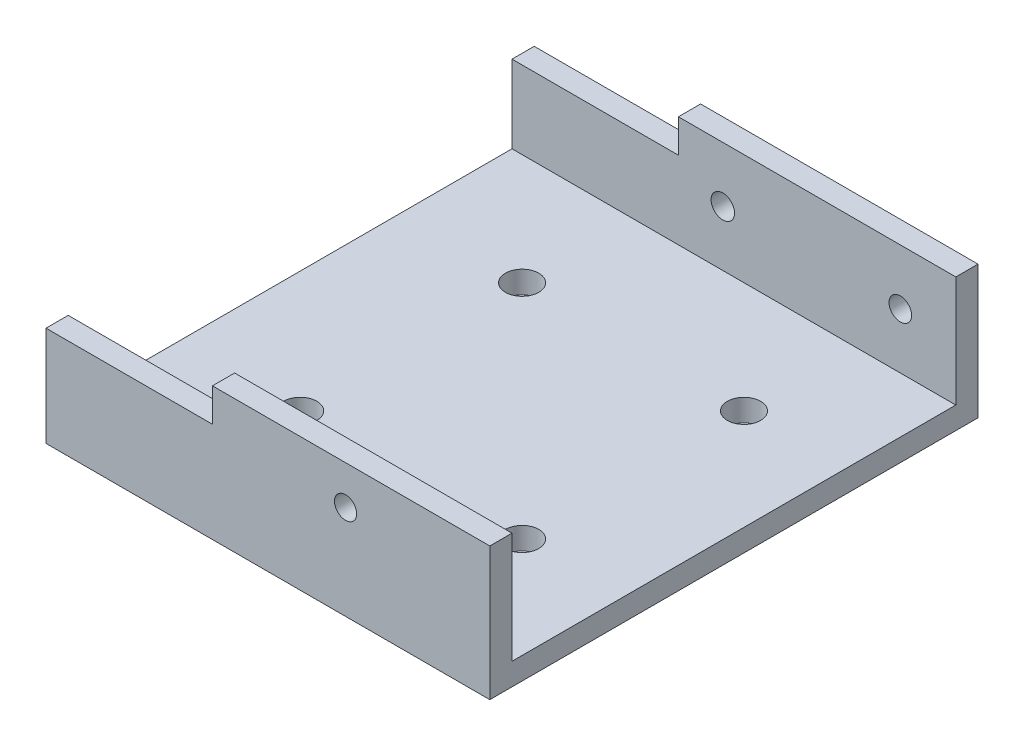
ISO-10303-21;
HEADER;
FILE_DESCRIPTION(('STEP AP214'),'2;1');
FILE_NAME('part.step','',(''),(''),'','','');
FILE_SCHEMA(('AUTOMOTIVE_DESIGN { 1 0 10303 214 1 1 1 1 }'));
ENDSEC;
DATA;
#1=APPLICATION_CONTEXT('core data for automotive mechanical design processes');
#2=APPLICATION_PROTOCOL_DEFINITION('international standard','automotive_design',2000,#1);
#3=PRODUCT_CONTEXT('',#1,'mechanical');
#4=PRODUCT('Part','Part','',(#3));
#5=PRODUCT_RELATED_PRODUCT_CATEGORY('part','',(#4));
#6=PRODUCT_DEFINITION_FORMATION('','',#4);
#7=PRODUCT_DEFINITION_CONTEXT('part definition',#1,'design');
#8=PRODUCT_DEFINITION('design','',#6,#7);
#9=PRODUCT_DEFINITION_SHAPE('','',#8);
#10=(LENGTH_UNIT() NAMED_UNIT(*) SI_UNIT(.MILLI.,.METRE.));
#11=(NAMED_UNIT(*) PLANE_ANGLE_UNIT() SI_UNIT($,.RADIAN.));
#12=(NAMED_UNIT(*) SI_UNIT($,.STERADIAN.) SOLID_ANGLE_UNIT());
#13=UNCERTAINTY_MEASURE_WITH_UNIT(LENGTH_MEASURE(1.E-05),#10,'distance_accuracy_value','');
#14=(GEOMETRIC_REPRESENTATION_CONTEXT(3) GLOBAL_UNCERTAINTY_ASSIGNED_CONTEXT((#13)) GLOBAL_UNIT_ASSIGNED_CONTEXT((#10,
#11,#12)) REPRESENTATION_CONTEXT('',''));
#15=CARTESIAN_POINT('',(0.,0.,0.));
#16=DIRECTION('',(0.,0.,1.));
#17=DIRECTION('',(1.,0.,0.));
#18=AXIS2_PLACEMENT_3D('',#15,#16,#17);
#19=CARTESIAN_POINT('',(0.,2.,0.));
#20=DIRECTION('',(0.,-1.,0.));
#21=DIRECTION('',(0.,0.,-1.));
#22=AXIS2_PLACEMENT_3D('',#19,#20,#21);
#23=PLANE('',#22);
#24=CARTESIAN_POINT('',(30.9090909090909,2.,-32.));
#25=DIRECTION('',(0.,-1.,0.));
#26=DIRECTION('',(0.,0.,-1.));
#27=AXIS2_PLACEMENT_3D('',#24,#25,#26);
#28=CIRCLE('',#27,1.5);
#29=CARTESIAN_POINT('',(30.9090909090909,2.,-33.5));
#30=VERTEX_POINT('',#29);
#31=EDGE_CURVE('E473',#30,#30,#28,.F.);
#32=ORIENTED_EDGE('',*,*,#31,.F.);
#33=EDGE_LOOP('',(#32));
#34=FACE_BOUND('',#33,.T.);
#35=CARTESIAN_POINT('',(30.9090909090909,2.,-12.));
#36=DIRECTION('',(0.,-1.,0.));
#37=DIRECTION('',(0.,0.,-1.));
#38=AXIS2_PLACEMENT_3D('',#35,#36,#37);
#39=CIRCLE('',#38,1.5);
#40=CARTESIAN_POINT('',(30.9090909090909,2.,-13.5));
#41=VERTEX_POINT('',#40);
#42=EDGE_CURVE('E477',#41,#41,#39,.F.);
#43=ORIENTED_EDGE('',*,*,#42,.F.);
#44=EDGE_LOOP('',(#43));
#45=FACE_BOUND('',#44,.T.);
#46=CARTESIAN_POINT('',(10.9090909090909,2.,-12.));
#47=DIRECTION('',(0.,-1.,0.));
#48=DIRECTION('',(0.,0.,-1.));
#49=AXIS2_PLACEMENT_3D('',#46,#47,#48);
#50=CIRCLE('',#49,1.5);
#51=CARTESIAN_POINT('',(10.9090909090909,2.,-13.5));
#52=VERTEX_POINT('',#51);
#53=EDGE_CURVE('E484',#52,#52,#50,.F.);
#54=ORIENTED_EDGE('',*,*,#53,.F.);
#55=EDGE_LOOP('',(#54));
#56=FACE_BOUND('',#55,.T.);
#57=CARTESIAN_POINT('',(10.9090909090909,2.,-32.));
#58=DIRECTION('',(0.,-1.,0.));
#59=DIRECTION('',(0.,0.,-1.));
#60=AXIS2_PLACEMENT_3D('',#57,#58,#59);
#61=CIRCLE('',#60,1.5);
#62=CARTESIAN_POINT('',(10.9090909090909,2.,-33.5));
#63=VERTEX_POINT('',#62);
#64=EDGE_CURVE('E290',#63,#63,#61,.F.);
#65=ORIENTED_EDGE('',*,*,#64,.F.);
#66=EDGE_LOOP('',(#65));
#67=FACE_BOUND('',#66,.T.);
#68=DIRECTION('',(-1.,0.,0.));
#69=VECTOR('',#68,1.);
#70=CARTESIAN_POINT('',(0.,2.,-2.));
#71=LINE('',#70,#69);
#72=CARTESIAN_POINT('',(40.,2.,-2.));
#73=VERTEX_POINT('',#72);
#74=CARTESIAN_POINT('',(0.,2.,-2.));
#75=VERTEX_POINT('',#74);
#76=EDGE_CURVE('E161',#73,#75,#71,.T.);
#77=ORIENTED_EDGE('',*,*,#76,.F.);
#78=DIRECTION('',(0.,0.,-1.));
#79=VECTOR('',#78,1.);
#80=CARTESIAN_POINT('',(40.,2.,0.));
#81=LINE('',#80,#79);
#82=CARTESIAN_POINT('',(40.,2.,-42.));
#83=VERTEX_POINT('',#82);
#84=EDGE_CURVE('E195',#73,#83,#81,.T.);
#85=ORIENTED_EDGE('',*,*,#84,.T.);
#86=DIRECTION('',(1.,0.,0.));
#87=VECTOR('',#86,1.);
#88=CARTESIAN_POINT('',(0.,2.,-42.));
#89=LINE('',#88,#87);
#90=CARTESIAN_POINT('',(0.,2.,-42.));
#91=VERTEX_POINT('',#90);
#92=EDGE_CURVE('E175',#91,#83,#89,.T.);
#93=ORIENTED_EDGE('',*,*,#92,.F.);
#94=DIRECTION('',(0.,0.,1.));
#95=VECTOR('',#94,1.);
#96=CARTESIAN_POINT('',(0.,2.,0.));
#97=LINE('',#96,#95);
#98=EDGE_CURVE('E192',#91,#75,#97,.T.);
#99=ORIENTED_EDGE('',*,*,#98,.T.);
#100=EDGE_LOOP('',(#77,#85,#93,#99));
#101=FACE_BOUND('',#100,.T.);
#102=ADVANCED_FACE('F32',(#34,#45,#56,#67,#101),#23,.F.);
#103=CARTESIAN_POINT('',(0.,2.,0.));
#104=DIRECTION('',(1.,0.,0.));
#105=DIRECTION('',(0.,0.,-1.));
#106=AXIS2_PLACEMENT_3D('',#103,#104,#105);
#107=PLANE('',#106);
#108=DIRECTION('',(0.,-1.,0.));
#109=VECTOR('',#108,1.);
#110=CARTESIAN_POINT('',(0.,2.,0.));
#111=LINE('',#110,#109);
#112=CARTESIAN_POINT('',(0.,9.,0.));
#113=VERTEX_POINT('',#112);
#114=CARTESIAN_POINT('',(0.,0.,0.));
#115=VERTEX_POINT('',#114);
#116=EDGE_CURVE('E40',#113,#115,#111,.T.);
#117=ORIENTED_EDGE('',*,*,#116,.F.);
#118=DIRECTION('',(0.,0.,-1.));
#119=VECTOR('',#118,1.);
#120=CARTESIAN_POINT('',(0.,9.,0.));
#121=LINE('',#120,#119);
#122=CARTESIAN_POINT('',(0.,9.,-2.));
#123=VERTEX_POINT('',#122);
#124=EDGE_CURVE('E133',#113,#123,#121,.T.);
#125=ORIENTED_EDGE('',*,*,#124,.T.);
#126=DIRECTION('',(0.,-1.,0.));
#127=VECTOR('',#126,1.);
#128=CARTESIAN_POINT('',(0.,12.,-2.));
#129=LINE('',#128,#127);
#130=EDGE_CURVE('E168',#123,#75,#129,.T.);
#131=ORIENTED_EDGE('',*,*,#130,.T.);
#132=ORIENTED_EDGE('',*,*,#98,.F.);
#133=DIRECTION('',(0.,-1.,0.));
#134=VECTOR('',#133,1.);
#135=CARTESIAN_POINT('',(0.,12.,-42.));
#136=LINE('',#135,#134);
#137=CARTESIAN_POINT('',(0.,9.,-42.));
#138=VERTEX_POINT('',#137);
#139=EDGE_CURVE('E189',#138,#91,#136,.T.);
#140=ORIENTED_EDGE('',*,*,#139,.F.);
#141=CARTESIAN_POINT('',(0.,9.,-44.));
#142=VERTEX_POINT('',#141);
#143=EDGE_CURVE('E126',#138,#142,#121,.T.);
#144=ORIENTED_EDGE('',*,*,#143,.T.);
#145=DIRECTION('',(0.,-1.,0.));
#146=VECTOR('',#145,1.);
#147=CARTESIAN_POINT('',(0.,2.,-44.));
#148=LINE('',#147,#146);
#149=CARTESIAN_POINT('',(0.,0.,-44.));
#150=VERTEX_POINT('',#149);
#151=EDGE_CURVE('E198',#142,#150,#148,.T.);
#152=ORIENTED_EDGE('',*,*,#151,.T.);
#153=DIRECTION('',(0.,0.,1.));
#154=VECTOR('',#153,1.);
#155=CARTESIAN_POINT('',(0.,0.,0.));
#156=LINE('',#155,#154);
#157=EDGE_CURVE('E191',#150,#115,#156,.T.);
#158=ORIENTED_EDGE('',*,*,#157,.T.);
#159=EDGE_LOOP('',(#117,#125,#131,#132,#140,#144,#152,#158));
#160=FACE_BOUND('',#159,.T.);
#161=ADVANCED_FACE('F34',(#160),#107,.F.);
#162=CARTESIAN_POINT('',(0.,2.,0.));
#163=DIRECTION('',(0.,0.,-1.));
#164=DIRECTION('',(-1.,0.,0.));
#165=AXIS2_PLACEMENT_3D('',#162,#163,#164);
#166=PLANE('',#165);
#167=CARTESIAN_POINT('',(27.,8.50000000000013,0.));
#168=DIRECTION('',(0.,0.,1.));
#169=DIRECTION('',(1.,0.,0.));
#170=AXIS2_PLACEMENT_3D('',#167,#168,#169);
#171=CIRCLE('',#170,1.);
#172=CARTESIAN_POINT('',(28.,8.50000000000013,0.));
#173=VERTEX_POINT('',#172);
#174=EDGE_CURVE('E283',#173,#173,#171,.T.);
#175=ORIENTED_EDGE('',*,*,#174,.F.);
#176=EDGE_LOOP('',(#175));
#177=FACE_BOUND('',#176,.T.);
#178=DIRECTION('',(0.,-1.,0.));
#179=VECTOR('',#178,1.);
#180=CARTESIAN_POINT('',(15.,12.,0.));
#181=LINE('',#180,#179);
#182=CARTESIAN_POINT('',(15.,12.,0.));
#183=VERTEX_POINT('',#182);
#184=CARTESIAN_POINT('',(15.,9.,0.));
#185=VERTEX_POINT('',#184);
#186=EDGE_CURVE('E55',#183,#185,#181,.T.);
#187=ORIENTED_EDGE('',*,*,#186,.T.);
#188=DIRECTION('',(-1.,0.,0.));
#189=VECTOR('',#188,1.);
#190=CARTESIAN_POINT('',(0.,9.,0.));
#191=LINE('',#190,#189);
#192=EDGE_CURVE('E130',#185,#113,#191,.T.);
#193=ORIENTED_EDGE('',*,*,#192,.T.);
#194=ORIENTED_EDGE('',*,*,#116,.T.);
#195=DIRECTION('',(1.,0.,0.));
#196=VECTOR('',#195,1.);
#197=CARTESIAN_POINT('',(0.,0.,0.));
#198=LINE('',#197,#196);
#199=CARTESIAN_POINT('',(40.,0.,0.));
#200=VERTEX_POINT('',#199);
#201=EDGE_CURVE('E201',#115,#200,#198,.T.);
#202=ORIENTED_EDGE('',*,*,#201,.T.);
#203=DIRECTION('',(0.,-1.,0.));
#204=VECTOR('',#203,1.);
#205=CARTESIAN_POINT('',(40.,2.,0.));
#206=LINE('',#205,#204);
#207=CARTESIAN_POINT('',(40.,12.,0.));
#208=VERTEX_POINT('',#207);
#209=EDGE_CURVE('E211',#208,#200,#206,.T.);
#210=ORIENTED_EDGE('',*,*,#209,.F.);
#211=DIRECTION('',(1.,0.,0.));
#212=VECTOR('',#211,1.);
#213=CARTESIAN_POINT('',(0.,12.,0.));
#214=LINE('',#213,#212);
#215=EDGE_CURVE('E141',#183,#208,#214,.T.);
#216=ORIENTED_EDGE('',*,*,#215,.F.);
#217=EDGE_LOOP('',(#187,#193,#194,#202,#210,#216));
#218=FACE_BOUND('',#217,.T.);
#219=ADVANCED_FACE('F139',(#177,#218),#166,.F.);
#220=CARTESIAN_POINT('',(40.,2.,0.));
#221=DIRECTION('',(-1.,0.,0.));
#222=DIRECTION('',(0.,0.,1.));
#223=AXIS2_PLACEMENT_3D('',#220,#221,#222);
#224=PLANE('',#223);
#225=DIRECTION('',(0.,0.,-1.));
#226=VECTOR('',#225,1.);
#227=CARTESIAN_POINT('',(40.,0.,0.));
#228=LINE('',#227,#226);
#229=CARTESIAN_POINT('',(40.,0.,-44.));
#230=VERTEX_POINT('',#229);
#231=EDGE_CURVE('E203',#200,#230,#228,.T.);
#232=ORIENTED_EDGE('',*,*,#231,.T.);
#233=DIRECTION('',(0.,-1.,0.));
#234=VECTOR('',#233,1.);
#235=CARTESIAN_POINT('',(40.,2.,-44.));
#236=LINE('',#235,#234);
#237=CARTESIAN_POINT('',(40.,12.,-44.));
#238=VERTEX_POINT('',#237);
#239=EDGE_CURVE('E208',#238,#230,#236,.T.);
#240=ORIENTED_EDGE('',*,*,#239,.F.);
#241=DIRECTION('',(0.,0.,-1.));
#242=VECTOR('',#241,1.);
#243=CARTESIAN_POINT('',(40.,12.,-44.));
#244=LINE('',#243,#242);
#245=CARTESIAN_POINT('',(40.,12.,-42.));
#246=VERTEX_POINT('',#245);
#247=EDGE_CURVE('E178',#246,#238,#244,.T.);
#248=ORIENTED_EDGE('',*,*,#247,.F.);
#249=DIRECTION('',(0.,-1.,0.));
#250=VECTOR('',#249,1.);
#251=CARTESIAN_POINT('',(40.,12.,-42.));
#252=LINE('',#251,#250);
#253=EDGE_CURVE('E184',#246,#83,#252,.T.);
#254=ORIENTED_EDGE('',*,*,#253,.T.);
#255=ORIENTED_EDGE('',*,*,#84,.F.);
#256=DIRECTION('',(0.,-1.,0.));
#257=VECTOR('',#256,1.);
#258=CARTESIAN_POINT('',(40.,12.,-2.));
#259=LINE('',#258,#257);
#260=CARTESIAN_POINT('',(40.,12.,-2.));
#261=VERTEX_POINT('',#260);
#262=EDGE_CURVE('E172',#261,#73,#259,.T.);
#263=ORIENTED_EDGE('',*,*,#262,.F.);
#264=DIRECTION('',(0.,0.,-1.));
#265=VECTOR('',#264,1.);
#266=CARTESIAN_POINT('',(40.,12.,0.));
#267=LINE('',#266,#265);
#268=EDGE_CURVE('E163',#208,#261,#267,.T.);
#269=ORIENTED_EDGE('',*,*,#268,.F.);
#270=ORIENTED_EDGE('',*,*,#209,.T.);
#271=EDGE_LOOP('',(#232,#240,#248,#254,#255,#263,#269,#270));
#272=FACE_BOUND('',#271,.T.);
#273=ADVANCED_FACE('F230',(#272),#224,.F.);
#274=CARTESIAN_POINT('',(0.,2.,-44.));
#275=DIRECTION('',(0.,0.,1.));
#276=DIRECTION('',(1.,0.,0.));
#277=AXIS2_PLACEMENT_3D('',#274,#275,#276);
#278=PLANE('',#277);
#279=CARTESIAN_POINT('',(35.,7.00000000000013,-44.));
#280=DIRECTION('',(0.,0.,1.));
#281=DIRECTION('',(1.,0.,0.));
#282=AXIS2_PLACEMENT_3D('',#279,#280,#281);
#283=CIRCLE('',#282,1.0171786141005);
#284=CARTESIAN_POINT('',(36.0171786141005,7.00000000000013,-44.));
#285=VERTEX_POINT('',#284);
#286=EDGE_CURVE('E296',#285,#285,#283,.T.);
#287=ORIENTED_EDGE('',*,*,#286,.T.);
#288=EDGE_LOOP('',(#287));
#289=FACE_BOUND('',#288,.T.);
#290=CARTESIAN_POINT('',(19.,7.00000000000013,-44.));
#291=DIRECTION('',(0.,0.,1.));
#292=DIRECTION('',(1.,0.,0.));
#293=AXIS2_PLACEMENT_3D('',#290,#291,#292);
#294=CIRCLE('',#293,1.05647541537035);
#295=CARTESIAN_POINT('',(20.0564754153703,7.00000000000013,-44.));
#296=VERTEX_POINT('',#295);
#297=EDGE_CURVE('E147',#296,#296,#294,.T.);
#298=ORIENTED_EDGE('',*,*,#297,.T.);
#299=EDGE_LOOP('',(#298));
#300=FACE_BOUND('',#299,.T.);
#301=ORIENTED_EDGE('',*,*,#151,.F.);
#302=DIRECTION('',(-1.,0.,0.));
#303=VECTOR('',#302,1.);
#304=CARTESIAN_POINT('',(0.,9.,-44.));
#305=LINE('',#304,#303);
#306=CARTESIAN_POINT('',(15.,9.,-44.));
#307=VERTEX_POINT('',#306);
#308=EDGE_CURVE('E142',#307,#142,#305,.T.);
#309=ORIENTED_EDGE('',*,*,#308,.F.);
#310=DIRECTION('',(0.,-1.,0.));
#311=VECTOR('',#310,1.);
#312=CARTESIAN_POINT('',(15.,12.,-44.));
#313=LINE('',#312,#311);
#314=CARTESIAN_POINT('',(15.,12.,-44.));
#315=VERTEX_POINT('',#314);
#316=EDGE_CURVE('E144',#315,#307,#313,.T.);
#317=ORIENTED_EDGE('',*,*,#316,.F.);
#318=DIRECTION('',(-1.,0.,0.));
#319=VECTOR('',#318,1.);
#320=CARTESIAN_POINT('',(0.,12.,-44.));
#321=LINE('',#320,#319);
#322=EDGE_CURVE('E181',#238,#315,#321,.T.);
#323=ORIENTED_EDGE('',*,*,#322,.F.);
#324=ORIENTED_EDGE('',*,*,#239,.T.);
#325=DIRECTION('',(-1.,0.,0.));
#326=VECTOR('',#325,1.);
#327=CARTESIAN_POINT('',(0.,0.,-44.));
#328=LINE('',#327,#326);
#329=EDGE_CURVE('E196',#230,#150,#328,.T.);
#330=ORIENTED_EDGE('',*,*,#329,.T.);
#331=EDGE_LOOP('',(#301,#309,#317,#323,#324,#330));
#332=FACE_BOUND('',#331,.T.);
#333=ADVANCED_FACE('F225',(#289,#300,#332),#278,.F.);
#334=CARTESIAN_POINT('',(0.,0.,0.));
#335=DIRECTION('',(0.,-1.,0.));
#336=DIRECTION('',(0.,0.,-1.));
#337=AXIS2_PLACEMENT_3D('',#334,#335,#336);
#338=PLANE('',#337);
#339=CARTESIAN_POINT('',(30.9090909090909,0.,-32.));
#340=DIRECTION('',(0.,-1.,0.));
#341=DIRECTION('',(0.,0.,-1.));
#342=AXIS2_PLACEMENT_3D('',#339,#340,#341);
#343=CIRCLE('',#342,1.5);
#344=CARTESIAN_POINT('',(30.9090909090909,0.,-33.5));
#345=VERTEX_POINT('',#344);
#346=EDGE_CURVE('E471',#345,#345,#343,.T.);
#347=ORIENTED_EDGE('',*,*,#346,.F.);
#348=EDGE_LOOP('',(#347));
#349=FACE_BOUND('',#348,.T.);
#350=CARTESIAN_POINT('',(30.9090909090909,0.,-12.));
#351=DIRECTION('',(0.,-1.,0.));
#352=DIRECTION('',(0.,0.,-1.));
#353=AXIS2_PLACEMENT_3D('',#350,#351,#352);
#354=CIRCLE('',#353,1.5);
#355=CARTESIAN_POINT('',(30.9090909090909,0.,-13.5));
#356=VERTEX_POINT('',#355);
#357=EDGE_CURVE('E474',#356,#356,#354,.T.);
#358=ORIENTED_EDGE('',*,*,#357,.F.);
#359=EDGE_LOOP('',(#358));
#360=FACE_BOUND('',#359,.T.);
#361=CARTESIAN_POINT('',(10.9090909090909,0.,-12.));
#362=DIRECTION('',(0.,-1.,0.));
#363=DIRECTION('',(0.,0.,-1.));
#364=AXIS2_PLACEMENT_3D('',#361,#362,#363);
#365=CIRCLE('',#364,1.5);
#366=CARTESIAN_POINT('',(10.9090909090909,0.,-13.5));
#367=VERTEX_POINT('',#366);
#368=EDGE_CURVE('E491',#367,#367,#365,.T.);
#369=ORIENTED_EDGE('',*,*,#368,.F.);
#370=EDGE_LOOP('',(#369));
#371=FACE_BOUND('',#370,.T.);
#372=CARTESIAN_POINT('',(10.9090909090909,0.,-32.));
#373=DIRECTION('',(0.,-1.,0.));
#374=DIRECTION('',(0.,0.,-1.));
#375=AXIS2_PLACEMENT_3D('',#372,#373,#374);
#376=CIRCLE('',#375,1.5);
#377=CARTESIAN_POINT('',(10.9090909090909,0.,-33.5));
#378=VERTEX_POINT('',#377);
#379=EDGE_CURVE('E482',#378,#378,#376,.T.);
#380=ORIENTED_EDGE('',*,*,#379,.F.);
#381=EDGE_LOOP('',(#380));
#382=FACE_BOUND('',#381,.T.);
#383=ORIENTED_EDGE('',*,*,#157,.F.);
#384=ORIENTED_EDGE('',*,*,#329,.F.);
#385=ORIENTED_EDGE('',*,*,#231,.F.);
#386=ORIENTED_EDGE('',*,*,#201,.F.);
#387=EDGE_LOOP('',(#383,#384,#385,#386));
#388=FACE_BOUND('',#387,.T.);
#389=ADVANCED_FACE('F218',(#349,#360,#371,#382,#388),#338,.T.);
#390=CARTESIAN_POINT('',(0.,12.,-42.));
#391=DIRECTION('',(0.,0.,-1.));
#392=DIRECTION('',(-1.,0.,0.));
#393=AXIS2_PLACEMENT_3D('',#390,#391,#392);
#394=PLANE('',#393);
#395=CARTESIAN_POINT('',(35.,7.00000000000013,-42.));
#396=DIRECTION('',(0.,0.,-1.));
#397=DIRECTION('',(-1.,0.,0.));
#398=AXIS2_PLACEMENT_3D('',#395,#396,#397);
#399=CIRCLE('',#398,1.0171786141005);
#400=CARTESIAN_POINT('',(33.9828213858995,7.00000000000013,-42.));
#401=VERTEX_POINT('',#400);
#402=EDGE_CURVE('E151',#401,#401,#399,.T.);
#403=ORIENTED_EDGE('',*,*,#402,.T.);
#404=EDGE_LOOP('',(#403));
#405=FACE_BOUND('',#404,.T.);
#406=CARTESIAN_POINT('',(19.,7.00000000000013,-42.));
#407=DIRECTION('',(0.,0.,-1.));
#408=DIRECTION('',(-1.,0.,0.));
#409=AXIS2_PLACEMENT_3D('',#406,#407,#408);
#410=CIRCLE('',#409,1.05647541537035);
#411=CARTESIAN_POINT('',(17.9435245846296,7.00000000000013,-42.));
#412=VERTEX_POINT('',#411);
#413=EDGE_CURVE('E288',#412,#412,#410,.T.);
#414=ORIENTED_EDGE('',*,*,#413,.T.);
#415=EDGE_LOOP('',(#414));
#416=FACE_BOUND('',#415,.T.);
#417=DIRECTION('',(0.,-1.,0.));
#418=VECTOR('',#417,1.);
#419=CARTESIAN_POINT('',(15.,12.,-42.));
#420=LINE('',#419,#418);
#421=CARTESIAN_POINT('',(15.,12.,-42.));
#422=VERTEX_POINT('',#421);
#423=CARTESIAN_POINT('',(15.,9.,-42.));
#424=VERTEX_POINT('',#423);
#425=EDGE_CURVE('E47',#422,#424,#420,.T.);
#426=ORIENTED_EDGE('',*,*,#425,.T.);
#427=DIRECTION('',(-1.,0.,0.));
#428=VECTOR('',#427,1.);
#429=CARTESIAN_POINT('',(0.,9.,-42.));
#430=LINE('',#429,#428);
#431=EDGE_CURVE('E158',#424,#138,#430,.T.);
#432=ORIENTED_EDGE('',*,*,#431,.T.);
#433=ORIENTED_EDGE('',*,*,#139,.T.);
#434=ORIENTED_EDGE('',*,*,#92,.T.);
#435=ORIENTED_EDGE('',*,*,#253,.F.);
#436=DIRECTION('',(1.,0.,0.));
#437=VECTOR('',#436,1.);
#438=CARTESIAN_POINT('',(0.,12.,-42.));
#439=LINE('',#438,#437);
#440=EDGE_CURVE('E176',#422,#246,#439,.T.);
#441=ORIENTED_EDGE('',*,*,#440,.F.);
#442=EDGE_LOOP('',(#426,#432,#433,#434,#435,#441));
#443=FACE_BOUND('',#442,.T.);
#444=ADVANCED_FACE('F236',(#405,#416,#443),#394,.F.);
#445=CARTESIAN_POINT('',(0.,12.,0.));
#446=DIRECTION('',(0.,1.,0.));
#447=DIRECTION('',(0.,0.,1.));
#448=AXIS2_PLACEMENT_3D('',#445,#446,#447);
#449=PLANE('',#448);
#450=DIRECTION('',(0.,0.,-1.));
#451=VECTOR('',#450,1.);
#452=CARTESIAN_POINT('',(15.,12.,0.));
#453=LINE('',#452,#451);
#454=EDGE_CURVE('E136',#422,#315,#453,.T.);
#455=ORIENTED_EDGE('',*,*,#454,.F.);
#456=ORIENTED_EDGE('',*,*,#440,.T.);
#457=ORIENTED_EDGE('',*,*,#247,.T.);
#458=ORIENTED_EDGE('',*,*,#322,.T.);
#459=EDGE_LOOP('',(#455,#456,#457,#458));
#460=FACE_BOUND('',#459,.T.);
#461=ADVANCED_FACE('F232',(#460),#449,.T.);
#462=CARTESIAN_POINT('',(0.,12.,-2.));
#463=DIRECTION('',(0.,0.,1.));
#464=DIRECTION('',(1.,0.,0.));
#465=AXIS2_PLACEMENT_3D('',#462,#463,#464);
#466=PLANE('',#465);
#467=CARTESIAN_POINT('',(27.,8.50000000000013,-2.));
#468=DIRECTION('',(0.,0.,1.));
#469=DIRECTION('',(1.,0.,0.));
#470=AXIS2_PLACEMENT_3D('',#467,#468,#469);
#471=CIRCLE('',#470,1.);
#472=CARTESIAN_POINT('',(28.,8.50000000000013,-2.));
#473=VERTEX_POINT('',#472);
#474=EDGE_CURVE('E285',#473,#473,#471,.F.);
#475=ORIENTED_EDGE('',*,*,#474,.F.);
#476=EDGE_LOOP('',(#475));
#477=FACE_BOUND('',#476,.T.);
#478=ORIENTED_EDGE('',*,*,#130,.F.);
#479=DIRECTION('',(1.,0.,0.));
#480=VECTOR('',#479,1.);
#481=CARTESIAN_POINT('',(0.,9.,-2.));
#482=LINE('',#481,#480);
#483=CARTESIAN_POINT('',(15.,9.,-2.));
#484=VERTEX_POINT('',#483);
#485=EDGE_CURVE('E11',#123,#484,#482,.T.);
#486=ORIENTED_EDGE('',*,*,#485,.T.);
#487=DIRECTION('',(0.,1.,0.));
#488=VECTOR('',#487,1.);
#489=CARTESIAN_POINT('',(15.,12.,-2.));
#490=LINE('',#489,#488);
#491=CARTESIAN_POINT('',(15.,12.,-2.));
#492=VERTEX_POINT('',#491);
#493=EDGE_CURVE('E124',#484,#492,#490,.T.);
#494=ORIENTED_EDGE('',*,*,#493,.T.);
#495=DIRECTION('',(-1.,0.,0.));
#496=VECTOR('',#495,1.);
#497=CARTESIAN_POINT('',(0.,12.,-2.));
#498=LINE('',#497,#496);
#499=EDGE_CURVE('E165',#261,#492,#498,.T.);
#500=ORIENTED_EDGE('',*,*,#499,.F.);
#501=ORIENTED_EDGE('',*,*,#262,.T.);
#502=ORIENTED_EDGE('',*,*,#76,.T.);
#503=EDGE_LOOP('',(#478,#486,#494,#500,#501,#502));
#504=FACE_BOUND('',#503,.T.);
#505=ADVANCED_FACE('F246',(#477,#504),#466,.F.);
#506=CARTESIAN_POINT('',(0.,12.,0.));
#507=DIRECTION('',(0.,-1.,0.));
#508=DIRECTION('',(0.,0.,-1.));
#509=AXIS2_PLACEMENT_3D('',#506,#507,#508);
#510=PLANE('',#509);
#511=ORIENTED_EDGE('',*,*,#499,.T.);
#512=EDGE_CURVE('E154',#183,#492,#453,.T.);
#513=ORIENTED_EDGE('',*,*,#512,.F.);
#514=ORIENTED_EDGE('',*,*,#215,.T.);
#515=ORIENTED_EDGE('',*,*,#268,.T.);
#516=EDGE_LOOP('',(#511,#513,#514,#515));
#517=FACE_BOUND('',#516,.T.);
#518=ADVANCED_FACE('F248',(#517),#510,.F.);
#519=CARTESIAN_POINT('',(15.,12.,0.));
#520=DIRECTION('',(1.,0.,0.));
#521=DIRECTION('',(0.,1.,0.));
#522=AXIS2_PLACEMENT_3D('',#519,#520,#521);
#523=PLANE('',#522);
#524=DIRECTION('',(0.,0.,-1.));
#525=VECTOR('',#524,1.);
#526=CARTESIAN_POINT('',(15.,9.,0.));
#527=LINE('',#526,#525);
#528=EDGE_CURVE('E120',#185,#484,#527,.T.);
#529=ORIENTED_EDGE('',*,*,#528,.F.);
#530=ORIENTED_EDGE('',*,*,#186,.F.);
#531=ORIENTED_EDGE('',*,*,#512,.T.);
#532=ORIENTED_EDGE('',*,*,#493,.F.);
#533=EDGE_LOOP('',(#529,#530,#531,#532));
#534=FACE_BOUND('',#533,.T.);
#535=ADVANCED_FACE('F122',(#534),#523,.F.);
#536=CARTESIAN_POINT('',(0.,9.,0.));
#537=DIRECTION('',(0.,-1.,0.));
#538=DIRECTION('',(1.,0.,0.));
#539=AXIS2_PLACEMENT_3D('',#536,#537,#538);
#540=PLANE('',#539);
#541=ORIENTED_EDGE('',*,*,#124,.F.);
#542=ORIENTED_EDGE('',*,*,#192,.F.);
#543=ORIENTED_EDGE('',*,*,#528,.T.);
#544=ORIENTED_EDGE('',*,*,#485,.F.);
#545=EDGE_LOOP('',(#541,#542,#543,#544));
#546=FACE_BOUND('',#545,.T.);
#547=ADVANCED_FACE('F131',(#546),#540,.F.);
#548=EDGE_CURVE('E127',#424,#307,#527,.T.);
#549=ORIENTED_EDGE('',*,*,#548,.T.);
#550=ORIENTED_EDGE('',*,*,#308,.T.);
#551=ORIENTED_EDGE('',*,*,#143,.F.);
#552=ORIENTED_EDGE('',*,*,#431,.F.);
#553=EDGE_LOOP('',(#549,#550,#551,#552));
#554=FACE_BOUND('',#553,.T.);
#555=ADVANCED_FACE('F316',(#554),#540,.F.);
#556=ORIENTED_EDGE('',*,*,#454,.T.);
#557=ORIENTED_EDGE('',*,*,#316,.T.);
#558=ORIENTED_EDGE('',*,*,#548,.F.);
#559=ORIENTED_EDGE('',*,*,#425,.F.);
#560=EDGE_LOOP('',(#556,#557,#558,#559));
#561=FACE_BOUND('',#560,.T.);
#562=ADVANCED_FACE('F256',(#561),#523,.F.);
#563=CARTESIAN_POINT('',(19.,7.00000000000013,-44.001));
#564=DIRECTION('',(0.,0.,1.));
#565=DIRECTION('',(1.,0.,0.));
#566=AXIS2_PLACEMENT_3D('',#563,#564,#565);
#567=CYLINDRICAL_SURFACE('',#566,1.05647541537035);
#568=ORIENTED_EDGE('',*,*,#413,.F.);
#569=EDGE_LOOP('',(#568));
#570=FACE_BOUND('',#569,.T.);
#571=ORIENTED_EDGE('',*,*,#297,.F.);
#572=EDGE_LOOP('',(#571));
#573=FACE_BOUND('',#572,.T.);
#574=ADVANCED_FACE('F302',(#570,#573),#567,.F.);
#575=CARTESIAN_POINT('',(35.,7.00000000000013,-44.001));
#576=DIRECTION('',(0.,0.,1.));
#577=DIRECTION('',(1.,0.,0.));
#578=AXIS2_PLACEMENT_3D('',#575,#576,#577);
#579=CYLINDRICAL_SURFACE('',#578,1.0171786141005);
#580=ORIENTED_EDGE('',*,*,#402,.F.);
#581=EDGE_LOOP('',(#580));
#582=FACE_BOUND('',#581,.T.);
#583=ORIENTED_EDGE('',*,*,#286,.F.);
#584=EDGE_LOOP('',(#583));
#585=FACE_BOUND('',#584,.T.);
#586=ADVANCED_FACE('F305',(#582,#585),#579,.F.);
#587=CARTESIAN_POINT('',(27.,8.50000000000013,-44.001));
#588=DIRECTION('',(0.,0.,1.));
#589=DIRECTION('',(1.,0.,0.));
#590=AXIS2_PLACEMENT_3D('',#587,#588,#589);
#591=CYLINDRICAL_SURFACE('',#590,1.);
#592=ORIENTED_EDGE('',*,*,#174,.T.);
#593=EDGE_LOOP('',(#592));
#594=FACE_BOUND('',#593,.T.);
#595=ORIENTED_EDGE('',*,*,#474,.T.);
#596=EDGE_LOOP('',(#595));
#597=FACE_BOUND('',#596,.T.);
#598=ADVANCED_FACE('F313',(#594,#597),#591,.F.);
#599=CARTESIAN_POINT('',(10.9090909090909,12.001,-32.));
#600=DIRECTION('',(0.,-1.,0.));
#601=DIRECTION('',(0.,0.,-1.));
#602=AXIS2_PLACEMENT_3D('',#599,#600,#601);
#603=CYLINDRICAL_SURFACE('',#602,1.5);
#604=ORIENTED_EDGE('',*,*,#379,.T.);
#605=EDGE_LOOP('',(#604));
#606=FACE_BOUND('',#605,.T.);
#607=ORIENTED_EDGE('',*,*,#64,.T.);
#608=EDGE_LOOP('',(#607));
#609=FACE_BOUND('',#608,.T.);
#610=ADVANCED_FACE('F403',(#606,#609),#603,.F.);
#611=CARTESIAN_POINT('',(10.9090909090909,12.001,-12.));
#612=DIRECTION('',(0.,-1.,0.));
#613=DIRECTION('',(0.,0.,-1.));
#614=AXIS2_PLACEMENT_3D('',#611,#612,#613);
#615=CYLINDRICAL_SURFACE('',#614,1.5);
#616=ORIENTED_EDGE('',*,*,#368,.T.);
#617=EDGE_LOOP('',(#616));
#618=FACE_BOUND('',#617,.T.);
#619=ORIENTED_EDGE('',*,*,#53,.T.);
#620=EDGE_LOOP('',(#619));
#621=FACE_BOUND('',#620,.T.);
#622=ADVANCED_FACE('F434',(#618,#621),#615,.F.);
#623=CARTESIAN_POINT('',(30.9090909090909,12.001,-12.));
#624=DIRECTION('',(0.,-1.,0.));
#625=DIRECTION('',(0.,0.,-1.));
#626=AXIS2_PLACEMENT_3D('',#623,#624,#625);
#627=CYLINDRICAL_SURFACE('',#626,1.5);
#628=ORIENTED_EDGE('',*,*,#357,.T.);
#629=EDGE_LOOP('',(#628));
#630=FACE_BOUND('',#629,.T.);
#631=ORIENTED_EDGE('',*,*,#42,.T.);
#632=EDGE_LOOP('',(#631));
#633=FACE_BOUND('',#632,.T.);
#634=ADVANCED_FACE('F441',(#630,#633),#627,.F.);
#635=CARTESIAN_POINT('',(30.9090909090909,12.001,-32.));
#636=DIRECTION('',(0.,-1.,0.));
#637=DIRECTION('',(0.,0.,-1.));
#638=AXIS2_PLACEMENT_3D('',#635,#636,#637);
#639=CYLINDRICAL_SURFACE('',#638,1.5);
#640=ORIENTED_EDGE('',*,*,#346,.T.);
#641=EDGE_LOOP('',(#640));
#642=FACE_BOUND('',#641,.T.);
#643=ORIENTED_EDGE('',*,*,#31,.T.);
#644=EDGE_LOOP('',(#643));
#645=FACE_BOUND('',#644,.T.);
#646=ADVANCED_FACE('F449',(#642,#645),#639,.F.);
#647=CLOSED_SHELL('',(#102,#161,#219,#273,#333,#389,#444,#461,#505,#518,#535,#547,#555,#562,
#574,#586,#598,#610,#622,#634,#646));
#648=MANIFOLD_SOLID_BREP('B2',#647);
#649=ADVANCED_BREP_SHAPE_REPRESENTATION('',(#18,#648),#14);
#650=SHAPE_DEFINITION_REPRESENTATION(#9,#649);
ENDSEC;
END-ISO-10303-21;
